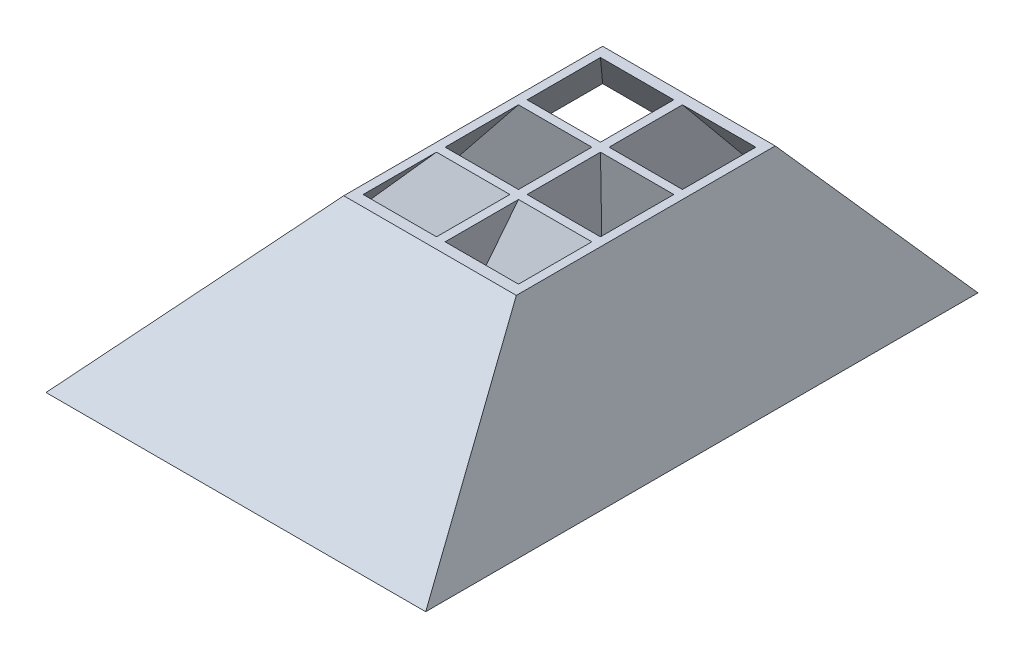
ISO-10303-21;
HEADER;
FILE_DESCRIPTION(('STEP AP214'),'2;1');
FILE_NAME('part.step','',(''),(''),'','','');
FILE_SCHEMA(('AUTOMOTIVE_DESIGN { 1 0 10303 214 1 1 1 1 }'));
ENDSEC;
DATA;
#1=APPLICATION_CONTEXT('core data for automotive mechanical design processes');
#2=APPLICATION_PROTOCOL_DEFINITION('international standard','automotive_design',2000,#1);
#3=PRODUCT_CONTEXT('',#1,'mechanical');
#4=PRODUCT('Part','Part','',(#3));
#5=PRODUCT_RELATED_PRODUCT_CATEGORY('part','',(#4));
#6=PRODUCT_DEFINITION_FORMATION('','',#4);
#7=PRODUCT_DEFINITION_CONTEXT('part definition',#1,'design');
#8=PRODUCT_DEFINITION('design','',#6,#7);
#9=PRODUCT_DEFINITION_SHAPE('','',#8);
#10=(LENGTH_UNIT() NAMED_UNIT(*) SI_UNIT(.MILLI.,.METRE.));
#11=(NAMED_UNIT(*) PLANE_ANGLE_UNIT() SI_UNIT($,.RADIAN.));
#12=(NAMED_UNIT(*) SI_UNIT($,.STERADIAN.) SOLID_ANGLE_UNIT());
#13=UNCERTAINTY_MEASURE_WITH_UNIT(LENGTH_MEASURE(1.E-05),#10,'distance_accuracy_value','');
#14=(GEOMETRIC_REPRESENTATION_CONTEXT(3) GLOBAL_UNCERTAINTY_ASSIGNED_CONTEXT((#13)) GLOBAL_UNIT_ASSIGNED_CONTEXT((#10,
#11,#12)) REPRESENTATION_CONTEXT('',''));
#15=CARTESIAN_POINT('',(0.,0.,0.));
#16=DIRECTION('',(0.,0.,1.));
#17=DIRECTION('',(1.,0.,0.));
#18=AXIS2_PLACEMENT_3D('',#15,#16,#17);
#19=CARTESIAN_POINT('',(37.5016060753418,20.,64.));
#20=DIRECTION('',(0.,-1.,0.));
#21=DIRECTION('',(1.,0.,0.));
#22=AXIS2_PLACEMENT_3D('',#19,#20,#21);
#23=PLANE('',#22);
#24=DIRECTION('',(1.,0.,0.));
#25=VECTOR('',#24,1.);
#26=CARTESIAN_POINT('',(28.001606075342,20.,37.25));
#27=LINE('',#26,#25);
#28=CARTESIAN_POINT('',(28.001606075342,20.,37.25));
#29=VERTEX_POINT('',#28);
#30=CARTESIAN_POINT('',(36.501606075342,20.,37.25));
#31=VERTEX_POINT('',#30);
#32=EDGE_CURVE('E275',#29,#31,#27,.T.);
#33=ORIENTED_EDGE('',*,*,#32,.T.);
#34=DIRECTION('',(0.,0.,1.));
#35=VECTOR('',#34,1.);
#36=CARTESIAN_POINT('',(36.501606075342,20.,37.25));
#37=LINE('',#36,#35);
#38=CARTESIAN_POINT('',(36.501606075342,20.,45.75));
#39=VERTEX_POINT('',#38);
#40=EDGE_CURVE('E285',#31,#39,#37,.T.);
#41=ORIENTED_EDGE('',*,*,#40,.T.);
#42=DIRECTION('',(1.,0.,0.));
#43=VECTOR('',#42,1.);
#44=CARTESIAN_POINT('',(28.001606075342,20.,45.75));
#45=LINE('',#44,#43);
#46=CARTESIAN_POINT('',(28.001606075342,20.,45.75));
#47=VERTEX_POINT('',#46);
#48=EDGE_CURVE('E85',#47,#39,#45,.T.);
#49=ORIENTED_EDGE('',*,*,#48,.F.);
#50=DIRECTION('',(0.,0.,1.));
#51=VECTOR('',#50,1.);
#52=CARTESIAN_POINT('',(28.001606075342,20.,37.25));
#53=LINE('',#52,#51);
#54=EDGE_CURVE('E292',#29,#47,#53,.T.);
#55=ORIENTED_EDGE('',*,*,#54,.F.);
#56=EDGE_LOOP('',(#33,#41,#49,#55));
#57=FACE_BOUND('',#56,.T.);
#58=DIRECTION('',(1.,0.,0.));
#59=VECTOR('',#58,1.);
#60=CARTESIAN_POINT('',(28.0016060753419,20.,27.75));
#61=LINE('',#60,#59);
#62=CARTESIAN_POINT('',(28.0016060753419,20.,27.75));
#63=VERTEX_POINT('',#62);
#64=CARTESIAN_POINT('',(36.5016060753419,20.,27.75));
#65=VERTEX_POINT('',#64);
#66=EDGE_CURVE('E323',#63,#65,#61,.T.);
#67=ORIENTED_EDGE('',*,*,#66,.T.);
#68=DIRECTION('',(0.,0.,1.));
#69=VECTOR('',#68,1.);
#70=CARTESIAN_POINT('',(36.5016060753419,20.,27.75));
#71=LINE('',#70,#69);
#72=CARTESIAN_POINT('',(36.5016060753419,20.,36.25));
#73=VERTEX_POINT('',#72);
#74=EDGE_CURVE('E412',#65,#73,#71,.T.);
#75=ORIENTED_EDGE('',*,*,#74,.T.);
#76=DIRECTION('',(1.,0.,0.));
#77=VECTOR('',#76,1.);
#78=CARTESIAN_POINT('',(28.0016060753419,20.,36.25));
#79=LINE('',#78,#77);
#80=CARTESIAN_POINT('',(28.0016060753419,20.,36.25));
#81=VERTEX_POINT('',#80);
#82=EDGE_CURVE('E406',#81,#73,#79,.T.);
#83=ORIENTED_EDGE('',*,*,#82,.F.);
#84=DIRECTION('',(0.,0.,1.));
#85=VECTOR('',#84,1.);
#86=CARTESIAN_POINT('',(28.0016060753419,20.,27.75));
#87=LINE('',#86,#85);
#88=EDGE_CURVE('E403',#63,#81,#87,.T.);
#89=ORIENTED_EDGE('',*,*,#88,.F.);
#90=EDGE_LOOP('',(#67,#75,#83,#89));
#91=FACE_BOUND('',#90,.T.);
#92=DIRECTION('',(0.,0.,1.));
#93=VECTOR('',#92,1.);
#94=CARTESIAN_POINT('',(18.501606075342,20.,37.2500000000001));
#95=LINE('',#94,#93);
#96=CARTESIAN_POINT('',(18.501606075342,20.,37.2500000000001));
#97=VERTEX_POINT('',#96);
#98=CARTESIAN_POINT('',(18.501606075342,20.,45.7500000000001));
#99=VERTEX_POINT('',#98);
#100=EDGE_CURVE('E663',#97,#99,#95,.T.);
#101=ORIENTED_EDGE('',*,*,#100,.F.);
#102=DIRECTION('',(1.,0.,0.));
#103=VECTOR('',#102,1.);
#104=CARTESIAN_POINT('',(18.501606075342,20.,37.2500000000001));
#105=LINE('',#104,#103);
#106=CARTESIAN_POINT('',(27.001606075342,20.,37.2500000000001));
#107=VERTEX_POINT('',#106);
#108=EDGE_CURVE('E662',#97,#107,#105,.T.);
#109=ORIENTED_EDGE('',*,*,#108,.T.);
#110=DIRECTION('',(0.,0.,1.));
#111=VECTOR('',#110,1.);
#112=CARTESIAN_POINT('',(27.001606075342,20.,37.2500000000001));
#113=LINE('',#112,#111);
#114=CARTESIAN_POINT('',(27.001606075342,20.,45.7500000000001));
#115=VERTEX_POINT('',#114);
#116=EDGE_CURVE('E668',#107,#115,#113,.T.);
#117=ORIENTED_EDGE('',*,*,#116,.T.);
#118=DIRECTION('',(1.,0.,0.));
#119=VECTOR('',#118,1.);
#120=CARTESIAN_POINT('',(18.501606075342,20.,45.7500000000001));
#121=LINE('',#120,#119);
#122=EDGE_CURVE('E671',#99,#115,#121,.T.);
#123=ORIENTED_EDGE('',*,*,#122,.F.);
#124=EDGE_LOOP('',(#101,#109,#117,#123));
#125=FACE_BOUND('',#124,.T.);
#126=DIRECTION('',(1.,0.,0.));
#127=VECTOR('',#126,1.);
#128=CARTESIAN_POINT('',(18.5016060753419,20.,27.7500000000001));
#129=LINE('',#128,#127);
#130=CARTESIAN_POINT('',(18.5016060753419,20.,27.7500000000001));
#131=VERTEX_POINT('',#130);
#132=CARTESIAN_POINT('',(27.0016060753419,20.,27.7500000000001));
#133=VERTEX_POINT('',#132);
#134=EDGE_CURVE('E605',#131,#133,#129,.T.);
#135=ORIENTED_EDGE('',*,*,#134,.T.);
#136=DIRECTION('',(0.,0.,1.));
#137=VECTOR('',#136,1.);
#138=CARTESIAN_POINT('',(27.0016060753419,20.,27.7500000000001));
#139=LINE('',#138,#137);
#140=CARTESIAN_POINT('',(27.0016060753419,20.,36.2500000000001));
#141=VERTEX_POINT('',#140);
#142=EDGE_CURVE('E602',#133,#141,#139,.T.);
#143=ORIENTED_EDGE('',*,*,#142,.T.);
#144=DIRECTION('',(1.,0.,0.));
#145=VECTOR('',#144,1.);
#146=CARTESIAN_POINT('',(18.5016060753419,20.,36.2500000000001));
#147=LINE('',#146,#145);
#148=CARTESIAN_POINT('',(18.5016060753419,20.,36.2500000000001));
#149=VERTEX_POINT('',#148);
#150=EDGE_CURVE('E599',#149,#141,#147,.T.);
#151=ORIENTED_EDGE('',*,*,#150,.F.);
#152=DIRECTION('',(0.,0.,1.));
#153=VECTOR('',#152,1.);
#154=CARTESIAN_POINT('',(18.5016060753419,20.,27.7500000000001));
#155=LINE('',#154,#153);
#156=EDGE_CURVE('E556',#131,#149,#155,.T.);
#157=ORIENTED_EDGE('',*,*,#156,.F.);
#158=EDGE_LOOP('',(#135,#143,#151,#157));
#159=FACE_BOUND('',#158,.T.);
#160=DIRECTION('',(1.,0.,0.));
#161=VECTOR('',#160,1.);
#162=CARTESIAN_POINT('',(18.5016060753418,20.,18.2500000000001));
#163=LINE('',#162,#161);
#164=CARTESIAN_POINT('',(18.5016060753418,20.,18.2500000000001));
#165=VERTEX_POINT('',#164);
#166=CARTESIAN_POINT('',(27.0016060753418,20.,18.2500000000001));
#167=VERTEX_POINT('',#166);
#168=EDGE_CURVE('E707',#165,#167,#163,.T.);
#169=ORIENTED_EDGE('',*,*,#168,.T.);
#170=DIRECTION('',(0.,0.,1.));
#171=VECTOR('',#170,1.);
#172=CARTESIAN_POINT('',(27.0016060753418,20.,18.2500000000001));
#173=LINE('',#172,#171);
#174=CARTESIAN_POINT('',(27.0016060753418,20.,26.7500000000001));
#175=VERTEX_POINT('',#174);
#176=EDGE_CURVE('E784',#167,#175,#173,.T.);
#177=ORIENTED_EDGE('',*,*,#176,.T.);
#178=DIRECTION('',(1.,0.,0.));
#179=VECTOR('',#178,1.);
#180=CARTESIAN_POINT('',(18.5016060753418,20.,26.7500000000001));
#181=LINE('',#180,#179);
#182=CARTESIAN_POINT('',(18.5016060753418,20.,26.7500000000001));
#183=VERTEX_POINT('',#182);
#184=EDGE_CURVE('E780',#183,#175,#181,.T.);
#185=ORIENTED_EDGE('',*,*,#184,.F.);
#186=DIRECTION('',(0.,0.,1.));
#187=VECTOR('',#186,1.);
#188=CARTESIAN_POINT('',(18.5016060753418,20.,18.2500000000001));
#189=LINE('',#188,#187);
#190=EDGE_CURVE('E777',#165,#183,#189,.T.);
#191=ORIENTED_EDGE('',*,*,#190,.F.);
#192=EDGE_LOOP('',(#169,#177,#185,#191));
#193=FACE_BOUND('',#192,.T.);
#194=DIRECTION('',(0.,0.,-1.));
#195=VECTOR('',#194,1.);
#196=CARTESIAN_POINT('',(37.5016060753418,20.,64.));
#197=LINE('',#196,#195);
#198=CARTESIAN_POINT('',(37.5016060753418,20.,47.));
#199=VERTEX_POINT('',#198);
#200=CARTESIAN_POINT('',(37.5016060753418,20.,17.));
#201=VERTEX_POINT('',#200);
#202=EDGE_CURVE('E12',#199,#201,#197,.T.);
#203=ORIENTED_EDGE('',*,*,#202,.T.);
#204=DIRECTION('',(-1.,0.,0.));
#205=VECTOR('',#204,1.);
#206=CARTESIAN_POINT('',(44.,20.,17.));
#207=LINE('',#206,#205);
#208=CARTESIAN_POINT('',(17.5016060753418,20.,17.));
#209=VERTEX_POINT('',#208);
#210=EDGE_CURVE('E712',#201,#209,#207,.T.);
#211=ORIENTED_EDGE('',*,*,#210,.T.);
#212=DIRECTION('',(0.,0.,-1.));
#213=VECTOR('',#212,1.);
#214=CARTESIAN_POINT('',(17.5016060753418,20.,64.));
#215=LINE('',#214,#213);
#216=CARTESIAN_POINT('',(17.5016060753418,20.,47.));
#217=VERTEX_POINT('',#216);
#218=EDGE_CURVE('E91',#217,#209,#215,.T.);
#219=ORIENTED_EDGE('',*,*,#218,.F.);
#220=DIRECTION('',(-1.,0.,0.));
#221=VECTOR('',#220,1.);
#222=CARTESIAN_POINT('',(44.,20.,47.));
#223=LINE('',#222,#221);
#224=EDGE_CURVE('E714',#199,#217,#223,.T.);
#225=ORIENTED_EDGE('',*,*,#224,.F.);
#226=EDGE_LOOP('',(#203,#211,#219,#225));
#227=FACE_BOUND('',#226,.T.);
#228=DIRECTION('',(1.,0.,0.));
#229=VECTOR('',#228,1.);
#230=CARTESIAN_POINT('',(28.0016060753418,20.,18.25));
#231=LINE('',#230,#229);
#232=CARTESIAN_POINT('',(28.0016060753418,20.,18.25));
#233=VERTEX_POINT('',#232);
#234=CARTESIAN_POINT('',(36.5016060753418,20.,18.25));
#235=VERTEX_POINT('',#234);
#236=EDGE_CURVE('E332',#233,#235,#231,.T.);
#237=ORIENTED_EDGE('',*,*,#236,.T.);
#238=DIRECTION('',(0.,0.,1.));
#239=VECTOR('',#238,1.);
#240=CARTESIAN_POINT('',(36.5016060753418,20.,18.25));
#241=LINE('',#240,#239);
#242=CARTESIAN_POINT('',(36.5016060753418,20.,26.75));
#243=VERTEX_POINT('',#242);
#244=EDGE_CURVE('E376',#235,#243,#241,.T.);
#245=ORIENTED_EDGE('',*,*,#244,.T.);
#246=DIRECTION('',(1.,0.,0.));
#247=VECTOR('',#246,1.);
#248=CARTESIAN_POINT('',(28.0016060753418,20.,26.75));
#249=LINE('',#248,#247);
#250=CARTESIAN_POINT('',(28.0016060753418,20.,26.75));
#251=VERTEX_POINT('',#250);
#252=EDGE_CURVE('E381',#251,#243,#249,.T.);
#253=ORIENTED_EDGE('',*,*,#252,.F.);
#254=DIRECTION('',(0.,0.,1.));
#255=VECTOR('',#254,1.);
#256=CARTESIAN_POINT('',(28.0016060753418,20.,18.25));
#257=LINE('',#256,#255);
#258=EDGE_CURVE('E379',#233,#251,#257,.T.);
#259=ORIENTED_EDGE('',*,*,#258,.F.);
#260=EDGE_LOOP('',(#237,#245,#253,#259));
#261=FACE_BOUND('',#260,.T.);
#262=ADVANCED_FACE('F81',(#57,#91,#125,#159,#193,#227,#261),#23,.F.);
#263=CARTESIAN_POINT('',(0.,0.,64.));
#264=DIRECTION('',(0.,1.,0.));
#265=DIRECTION('',(0.,0.,1.));
#266=AXIS2_PLACEMENT_3D('',#263,#264,#265);
#267=PLANE('',#266);
#268=DIRECTION('',(1.,0.,0.));
#269=VECTOR('',#268,1.);
#270=CARTESIAN_POINT('',(22.25,0.,63.25));
#271=LINE('',#270,#269);
#272=CARTESIAN_POINT('',(22.25,0.,63.25));
#273=VERTEX_POINT('',#272);
#274=CARTESIAN_POINT('',(42.75,0.,63.25));
#275=VERTEX_POINT('',#274);
#276=EDGE_CURVE('E107',#273,#275,#271,.T.);
#277=ORIENTED_EDGE('',*,*,#276,.T.);
#278=DIRECTION('',(0.,0.,-1.));
#279=VECTOR('',#278,1.);
#280=CARTESIAN_POINT('',(42.75,0.,63.25));
#281=LINE('',#280,#279);
#282=CARTESIAN_POINT('',(42.75,0.,42.75));
#283=VERTEX_POINT('',#282);
#284=EDGE_CURVE('E304',#275,#283,#281,.T.);
#285=ORIENTED_EDGE('',*,*,#284,.T.);
#286=DIRECTION('',(1.,0.,0.));
#287=VECTOR('',#286,1.);
#288=CARTESIAN_POINT('',(22.25,0.,42.75));
#289=LINE('',#288,#287);
#290=CARTESIAN_POINT('',(22.25,0.,42.75));
#291=VERTEX_POINT('',#290);
#292=EDGE_CURVE('E278',#291,#283,#289,.T.);
#293=ORIENTED_EDGE('',*,*,#292,.F.);
#294=DIRECTION('',(0.,0.,-1.));
#295=VECTOR('',#294,1.);
#296=CARTESIAN_POINT('',(22.25,0.,63.25));
#297=LINE('',#296,#295);
#298=EDGE_CURVE('E407',#273,#291,#297,.T.);
#299=ORIENTED_EDGE('',*,*,#298,.F.);
#300=EDGE_LOOP('',(#277,#285,#293,#299));
#301=FACE_BOUND('',#300,.T.);
#302=DIRECTION('',(1.,0.,0.));
#303=VECTOR('',#302,1.);
#304=CARTESIAN_POINT('',(22.2500000000002,0.,42.25));
#305=LINE('',#304,#303);
#306=CARTESIAN_POINT('',(22.2500000000002,0.,42.25));
#307=VERTEX_POINT('',#306);
#308=CARTESIAN_POINT('',(42.7500000000002,0.,42.25));
#309=VERTEX_POINT('',#308);
#310=EDGE_CURVE('E382',#307,#309,#305,.T.);
#311=ORIENTED_EDGE('',*,*,#310,.T.);
#312=DIRECTION('',(0.,0.,-1.));
#313=VECTOR('',#312,1.);
#314=CARTESIAN_POINT('',(42.7500000000002,0.,42.25));
#315=LINE('',#314,#313);
#316=CARTESIAN_POINT('',(42.7500000000002,0.,21.75));
#317=VERTEX_POINT('',#316);
#318=EDGE_CURVE('E392',#309,#317,#315,.T.);
#319=ORIENTED_EDGE('',*,*,#318,.T.);
#320=DIRECTION('',(1.,0.,0.));
#321=VECTOR('',#320,1.);
#322=CARTESIAN_POINT('',(22.2500000000002,0.,21.75));
#323=LINE('',#322,#321);
#324=CARTESIAN_POINT('',(22.2500000000002,0.,21.75));
#325=VERTEX_POINT('',#324);
#326=EDGE_CURVE('E387',#325,#317,#323,.T.);
#327=ORIENTED_EDGE('',*,*,#326,.F.);
#328=DIRECTION('',(0.,0.,-1.));
#329=VECTOR('',#328,1.);
#330=CARTESIAN_POINT('',(22.2500000000002,0.,42.25));
#331=LINE('',#330,#329);
#332=EDGE_CURVE('E313',#307,#325,#331,.T.);
#333=ORIENTED_EDGE('',*,*,#332,.F.);
#334=EDGE_LOOP('',(#311,#319,#327,#333));
#335=FACE_BOUND('',#334,.T.);
#336=DIRECTION('',(0.,0.,-1.));
#337=VECTOR('',#336,1.);
#338=CARTESIAN_POINT('',(1.24999999999999,0.,63.2499999999999));
#339=LINE('',#338,#337);
#340=CARTESIAN_POINT('',(1.24999999999999,0.,63.2499999999999));
#341=VERTEX_POINT('',#340);
#342=CARTESIAN_POINT('',(1.24999999999999,0.,42.7499999999998));
#343=VERTEX_POINT('',#342);
#344=EDGE_CURVE('E544',#341,#343,#339,.T.);
#345=ORIENTED_EDGE('',*,*,#344,.F.);
#346=DIRECTION('',(1.,0.,0.));
#347=VECTOR('',#346,1.);
#348=CARTESIAN_POINT('',(1.24999999999999,0.,63.2499999999999));
#349=LINE('',#348,#347);
#350=CARTESIAN_POINT('',(21.75,0.,63.2499999999999));
#351=VERTEX_POINT('',#350);
#352=EDGE_CURVE('E537',#341,#351,#349,.T.);
#353=ORIENTED_EDGE('',*,*,#352,.T.);
#354=DIRECTION('',(0.,0.,-1.));
#355=VECTOR('',#354,1.);
#356=CARTESIAN_POINT('',(21.75,0.,63.2499999999999));
#357=LINE('',#356,#355);
#358=CARTESIAN_POINT('',(21.75,0.,42.7499999999999));
#359=VERTEX_POINT('',#358);
#360=EDGE_CURVE('E528',#351,#359,#357,.T.);
#361=ORIENTED_EDGE('',*,*,#360,.T.);
#362=DIRECTION('',(1.,0.,0.));
#363=VECTOR('',#362,1.);
#364=CARTESIAN_POINT('',(1.24999999999999,0.,42.7499999999998));
#365=LINE('',#364,#363);
#366=EDGE_CURVE('E536',#343,#359,#365,.T.);
#367=ORIENTED_EDGE('',*,*,#366,.F.);
#368=EDGE_LOOP('',(#345,#353,#361,#367));
#369=FACE_BOUND('',#368,.T.);
#370=DIRECTION('',(1.,0.,0.));
#371=VECTOR('',#370,1.);
#372=CARTESIAN_POINT('',(1.25000000000021,0.,42.2499999999998));
#373=LINE('',#372,#371);
#374=CARTESIAN_POINT('',(1.25000000000021,0.,42.2499999999998));
#375=VERTEX_POINT('',#374);
#376=CARTESIAN_POINT('',(21.7500000000002,0.,42.2499999999998));
#377=VERTEX_POINT('',#376);
#378=EDGE_CURVE('E1181',#375,#377,#373,.T.);
#379=ORIENTED_EDGE('',*,*,#378,.T.);
#380=DIRECTION('',(0.,0.,-1.));
#381=VECTOR('',#380,1.);
#382=CARTESIAN_POINT('',(21.7500000000002,0.,42.2499999999998));
#383=LINE('',#382,#381);
#384=CARTESIAN_POINT('',(21.7500000000002,0.,21.7499999999999));
#385=VERTEX_POINT('',#384);
#386=EDGE_CURVE('E1190',#377,#385,#383,.T.);
#387=ORIENTED_EDGE('',*,*,#386,.T.);
#388=DIRECTION('',(1.,0.,0.));
#389=VECTOR('',#388,1.);
#390=CARTESIAN_POINT('',(1.25000000000021,0.,21.7499999999998));
#391=LINE('',#390,#389);
#392=CARTESIAN_POINT('',(1.25000000000021,0.,21.7499999999998));
#393=VERTEX_POINT('',#392);
#394=EDGE_CURVE('E1193',#393,#385,#391,.T.);
#395=ORIENTED_EDGE('',*,*,#394,.F.);
#396=DIRECTION('',(0.,0.,-1.));
#397=VECTOR('',#396,1.);
#398=CARTESIAN_POINT('',(1.25000000000021,0.,42.2499999999998));
#399=LINE('',#398,#397);
#400=EDGE_CURVE('E781',#375,#393,#399,.T.);
#401=ORIENTED_EDGE('',*,*,#400,.F.);
#402=EDGE_LOOP('',(#379,#387,#395,#401));
#403=FACE_BOUND('',#402,.T.);
#404=DIRECTION('',(1.,0.,0.));
#405=VECTOR('',#404,1.);
#406=CARTESIAN_POINT('',(1.25000000000043,0.,21.2499999999998));
#407=LINE('',#406,#405);
#408=CARTESIAN_POINT('',(1.25000000000043,0.,21.2499999999998));
#409=VERTEX_POINT('',#408);
#410=CARTESIAN_POINT('',(21.7500000000004,0.,21.2499999999998));
#411=VERTEX_POINT('',#410);
#412=EDGE_CURVE('E752',#409,#411,#407,.T.);
#413=ORIENTED_EDGE('',*,*,#412,.T.);
#414=DIRECTION('',(0.,0.,-1.));
#415=VECTOR('',#414,1.);
#416=CARTESIAN_POINT('',(21.7500000000004,0.,21.2499999999998));
#417=LINE('',#416,#415);
#418=CARTESIAN_POINT('',(21.7500000000004,0.,0.749999999999851));
#419=VERTEX_POINT('',#418);
#420=EDGE_CURVE('E759',#411,#419,#417,.T.);
#421=ORIENTED_EDGE('',*,*,#420,.T.);
#422=DIRECTION('',(1.,0.,0.));
#423=VECTOR('',#422,1.);
#424=CARTESIAN_POINT('',(1.25000000000043,0.,0.749999999999841));
#425=LINE('',#424,#423);
#426=CARTESIAN_POINT('',(1.25000000000043,0.,0.749999999999848));
#427=VERTEX_POINT('',#426);
#428=EDGE_CURVE('E754',#427,#419,#425,.T.);
#429=ORIENTED_EDGE('',*,*,#428,.F.);
#430=DIRECTION('',(0.,0.,-1.));
#431=VECTOR('',#430,1.);
#432=CARTESIAN_POINT('',(1.25000000000043,0.,21.2499999999998));
#433=LINE('',#432,#431);
#434=EDGE_CURVE('E748',#409,#427,#433,.T.);
#435=ORIENTED_EDGE('',*,*,#434,.F.);
#436=EDGE_LOOP('',(#413,#421,#429,#435));
#437=FACE_BOUND('',#436,.T.);
#438=DIRECTION('',(1.,0.,0.));
#439=VECTOR('',#438,1.);
#440=CARTESIAN_POINT('',(0.,0.,0.));
#441=LINE('',#440,#439);
#442=CARTESIAN_POINT('',(0.,0.,0.));
#443=VERTEX_POINT('',#442);
#444=CARTESIAN_POINT('',(44.,0.,0.));
#445=VERTEX_POINT('',#444);
#446=EDGE_CURVE('E735',#443,#445,#441,.T.);
#447=ORIENTED_EDGE('',*,*,#446,.T.);
#448=DIRECTION('',(0.,0.,-1.));
#449=VECTOR('',#448,1.);
#450=CARTESIAN_POINT('',(44.,0.,64.));
#451=LINE('',#450,#449);
#452=CARTESIAN_POINT('',(44.,0.,64.));
#453=VERTEX_POINT('',#452);
#454=EDGE_CURVE('E722',#453,#445,#451,.T.);
#455=ORIENTED_EDGE('',*,*,#454,.F.);
#456=DIRECTION('',(1.,0.,0.));
#457=VECTOR('',#456,1.);
#458=CARTESIAN_POINT('',(0.,0.,64.));
#459=LINE('',#458,#457);
#460=CARTESIAN_POINT('',(0.,0.,64.));
#461=VERTEX_POINT('',#460);
#462=EDGE_CURVE('E736',#461,#453,#459,.T.);
#463=ORIENTED_EDGE('',*,*,#462,.F.);
#464=DIRECTION('',(0.,0.,-1.));
#465=VECTOR('',#464,1.);
#466=CARTESIAN_POINT('',(0.,0.,64.));
#467=LINE('',#466,#465);
#468=EDGE_CURVE('E740',#461,#443,#467,.T.);
#469=ORIENTED_EDGE('',*,*,#468,.T.);
#470=EDGE_LOOP('',(#447,#455,#463,#469));
#471=FACE_BOUND('',#470,.T.);
#472=DIRECTION('',(1.,0.,0.));
#473=VECTOR('',#472,1.);
#474=CARTESIAN_POINT('',(22.2500000000004,0.,0.749999999999987));
#475=LINE('',#474,#473);
#476=CARTESIAN_POINT('',(22.2500000000004,0.,0.749999999999983));
#477=VERTEX_POINT('',#476);
#478=CARTESIAN_POINT('',(42.7500000000004,0.,0.749999999999994));
#479=VERTEX_POINT('',#478);
#480=EDGE_CURVE('E1157',#477,#479,#475,.T.);
#481=ORIENTED_EDGE('',*,*,#480,.F.);
#482=DIRECTION('',(0.,0.,-1.));
#483=VECTOR('',#482,1.);
#484=CARTESIAN_POINT('',(22.2500000000004,0.,21.25));
#485=LINE('',#484,#483);
#486=CARTESIAN_POINT('',(22.2500000000004,0.,21.25));
#487=VERTEX_POINT('',#486);
#488=EDGE_CURVE('E1150',#487,#477,#485,.T.);
#489=ORIENTED_EDGE('',*,*,#488,.F.);
#490=DIRECTION('',(1.,0.,0.));
#491=VECTOR('',#490,1.);
#492=CARTESIAN_POINT('',(22.2500000000004,0.,21.25));
#493=LINE('',#492,#491);
#494=CARTESIAN_POINT('',(42.7500000000004,0.,21.25));
#495=VERTEX_POINT('',#494);
#496=EDGE_CURVE('E492',#487,#495,#493,.T.);
#497=ORIENTED_EDGE('',*,*,#496,.T.);
#498=DIRECTION('',(0.,0.,-1.));
#499=VECTOR('',#498,1.);
#500=CARTESIAN_POINT('',(42.7500000000004,0.,21.25));
#501=LINE('',#500,#499);
#502=EDGE_CURVE('E1160',#495,#479,#501,.T.);
#503=ORIENTED_EDGE('',*,*,#502,.T.);
#504=EDGE_LOOP('',(#481,#489,#497,#503));
#505=FACE_BOUND('',#504,.T.);
#506=ADVANCED_FACE('F431',(#301,#335,#369,#403,#437,#471,#505),#267,.F.);
#507=CARTESIAN_POINT('',(44.,0.,64.));
#508=DIRECTION('',(-0.951056516295152,-0.309016994374952,0.));
#509=DIRECTION('',(0.309016994374952,-0.951056516295152,0.));
#510=AXIS2_PLACEMENT_3D('',#507,#508,#509);
#511=PLANE('',#510);
#512=ORIENTED_EDGE('',*,*,#454,.T.);
#513=DIRECTION('',(-0.240314122722964,0.739610819255167,0.628669196366892));
#514=VECTOR('',#513,1.);
#515=CARTESIAN_POINT('',(34.3310024698969,29.7581145193859,25.294397341478));
#516=LINE('',#515,#514);
#517=EDGE_CURVE('E721',#445,#201,#516,.T.);
#518=ORIENTED_EDGE('',*,*,#517,.T.);
#519=ORIENTED_EDGE('',*,*,#202,.F.);
#520=DIRECTION('',(0.240314122722964,-0.739610819255167,0.628669196366892));
#521=VECTOR('',#520,1.);
#522=CARTESIAN_POINT('',(44.,0.,64.));
#523=LINE('',#522,#521);
#524=EDGE_CURVE('E719',#199,#453,#523,.T.);
#525=ORIENTED_EDGE('',*,*,#524,.T.);
#526=EDGE_LOOP('',(#512,#518,#519,#525));
#527=FACE_BOUND('',#526,.T.);
#528=ADVANCED_FACE('F83',(#527),#511,.F.);
#529=CARTESIAN_POINT('',(17.5016060753418,20.,64.));
#530=DIRECTION('',(0.752546745159007,-0.658538834352678,0.));
#531=DIRECTION('',(0.658538834352678,0.752546745159007,0.));
#532=AXIS2_PLACEMENT_3D('',#529,#530,#531);
#533=PLANE('',#532);
#534=ORIENTED_EDGE('',*,*,#218,.T.);
#535=DIRECTION('',(-0.554752855706336,-0.633945082889203,-0.538853320455823));
#536=VECTOR('',#535,1.);
#537=CARTESIAN_POINT('',(31.5513357368381,36.05536040637,30.6470563454145));
#538=LINE('',#537,#536);
#539=EDGE_CURVE('E726',#209,#443,#538,.T.);
#540=ORIENTED_EDGE('',*,*,#539,.T.);
#541=ORIENTED_EDGE('',*,*,#468,.F.);
#542=DIRECTION('',(0.554752855706336,0.633945082889203,-0.538853320455823));
#543=VECTOR('',#542,1.);
#544=CARTESIAN_POINT('',(12.4197889637367,14.1927419806747,51.9361693164265));
#545=LINE('',#544,#543);
#546=EDGE_CURVE('E725',#461,#217,#545,.T.);
#547=ORIENTED_EDGE('',*,*,#546,.T.);
#548=EDGE_LOOP('',(#534,#540,#541,#547));
#549=FACE_BOUND('',#548,.T.);
#550=ADVANCED_FACE('F443',(#549),#533,.F.);
#551=CARTESIAN_POINT('',(44.,0.,0.));
#552=DIRECTION('',(0.,-0.647648420095541,0.761939317759459));
#553=DIRECTION('',(0.,-0.761939317759459,-0.647648420095541));
#554=AXIS2_PLACEMENT_3D('',#551,#552,#553);
#555=PLANE('',#554);
#556=ORIENTED_EDGE('',*,*,#446,.F.);
#557=ORIENTED_EDGE('',*,*,#539,.F.);
#558=ORIENTED_EDGE('',*,*,#210,.F.);
#559=ORIENTED_EDGE('',*,*,#517,.F.);
#560=EDGE_LOOP('',(#556,#557,#558,#559));
#561=FACE_BOUND('',#560,.T.);
#562=ADVANCED_FACE('F845',(#561),#555,.F.);
#563=CARTESIAN_POINT('',(44.,0.,64.));
#564=DIRECTION('',(0.,-0.647648420095541,-0.761939317759459));
#565=DIRECTION('',(0.,0.761939317759459,-0.647648420095541));
#566=AXIS2_PLACEMENT_3D('',#563,#564,#565);
#567=PLANE('',#566);
#568=ORIENTED_EDGE('',*,*,#224,.T.);
#569=ORIENTED_EDGE('',*,*,#546,.F.);
#570=ORIENTED_EDGE('',*,*,#462,.T.);
#571=ORIENTED_EDGE('',*,*,#524,.F.);
#572=EDGE_LOOP('',(#568,#569,#570,#571));
#573=FACE_BOUND('',#572,.T.);
#574=ADVANCED_FACE('F441',(#573),#567,.F.);
#575=CARTESIAN_POINT('',(20.347099706538,-5.34274762172154,0.));
#576=DIRECTION('',(0.967211888410285,-0.25397079146589,0.));
#577=DIRECTION('',(0.25397079146589,0.967211888410285,0.));
#578=AXIS2_PLACEMENT_3D('',#575,#576,#577);
#579=PLANE('',#578);
#580=DIRECTION('',(-0.245437161169701,-0.93471276271897,-0.257046009747727));
#581=VECTOR('',#580,1.);
#582=CARTESIAN_POINT('',(27.0016060753418,20.,26.7500000000001));
#583=LINE('',#582,#581);
#584=EDGE_CURVE('E790',#175,#411,#583,.T.);
#585=ORIENTED_EDGE('',*,*,#584,.F.);
#586=ORIENTED_EDGE('',*,*,#176,.F.);
#587=DIRECTION('',(-0.193862852379713,-0.738299292058433,-0.646011880551137));
#588=VECTOR('',#587,1.);
#589=CARTESIAN_POINT('',(27.0016060753418,20.,18.2500000000001));
#590=LINE('',#589,#588);
#591=EDGE_CURVE('E822',#167,#419,#590,.T.);
#592=ORIENTED_EDGE('',*,*,#591,.T.);
#593=ORIENTED_EDGE('',*,*,#420,.F.);
#594=EDGE_LOOP('',(#585,#586,#592,#593));
#595=FACE_BOUND('',#594,.T.);
#596=ADVANCED_FACE('F577',(#595),#579,.F.);
#597=CARTESIAN_POINT('',(0.,-0.371681415929125,0.424778761061852));
#598=DIRECTION('',(0.,-0.658504607868523,0.752576694706874));
#599=DIRECTION('',(0.,-0.752576694706874,-0.658504607868523));
#600=AXIS2_PLACEMENT_3D('',#597,#598,#599);
#601=PLANE('',#600);
#602=ORIENTED_EDGE('',*,*,#591,.F.);
#603=ORIENTED_EDGE('',*,*,#168,.F.);
#604=DIRECTION('',(-0.544491678229655,-0.631235927660008,-0.552331436702514));
#605=VECTOR('',#604,1.);
#606=CARTESIAN_POINT('',(18.5016060753418,20.,18.2500000000001));
#607=LINE('',#606,#605);
#608=EDGE_CURVE('E757',#165,#427,#607,.T.);
#609=ORIENTED_EDGE('',*,*,#608,.T.);
#610=ORIENTED_EDGE('',*,*,#428,.T.);
#611=EDGE_LOOP('',(#602,#603,#609,#610));
#612=FACE_BOUND('',#611,.T.);
#613=ADVANCED_FACE('F798',(#612),#601,.T.);
#614=CARTESIAN_POINT('',(0.,-5.43288785589789,19.7559558396279));
#615=DIRECTION('',(0.,-0.265156483021052,0.964205392803788));
#616=DIRECTION('',(0.,-0.964205392803788,-0.265156483021052));
#617=AXIS2_PLACEMENT_3D('',#614,#615,#616);
#618=PLANE('',#617);
#619=DIRECTION('',(-0.63944507360227,-0.741316571697361,-0.203862057216783));
#620=VECTOR('',#619,1.);
#621=CARTESIAN_POINT('',(18.5016060753418,20.,26.7500000000001));
#622=LINE('',#621,#620);
#623=EDGE_CURVE('E761',#183,#409,#622,.T.);
#624=ORIENTED_EDGE('',*,*,#623,.F.);
#625=ORIENTED_EDGE('',*,*,#184,.T.);
#626=ORIENTED_EDGE('',*,*,#584,.T.);
#627=ORIENTED_EDGE('',*,*,#412,.F.);
#628=EDGE_LOOP('',(#624,#625,#626,#627));
#629=FACE_BOUND('',#628,.T.);
#630=ADVANCED_FACE('F807',(#629),#618,.F.);
#631=CARTESIAN_POINT('',(0.716724716024861,-0.618232623266089,0.));
#632=DIRECTION('',(0.757218444584975,-0.653161715948134,0.));
#633=DIRECTION('',(0.653161715948134,0.757218444584975,0.));
#634=AXIS2_PLACEMENT_3D('',#631,#632,#633);
#635=PLANE('',#634);
#636=ORIENTED_EDGE('',*,*,#608,.F.);
#637=ORIENTED_EDGE('',*,*,#190,.T.);
#638=ORIENTED_EDGE('',*,*,#623,.T.);
#639=ORIENTED_EDGE('',*,*,#434,.T.);
#640=EDGE_LOOP('',(#636,#637,#638,#639));
#641=FACE_BOUND('',#640,.T.);
#642=ADVANCED_FACE('F836',(#641),#635,.T.);
#643=CARTESIAN_POINT('',(20.3470997065377,-5.34274762172177,0.));
#644=DIRECTION('',(0.967211888410281,-0.253970791465905,0.));
#645=DIRECTION('',(0.253970791465905,0.967211888410281,0.));
#646=AXIS2_PLACEMENT_3D('',#643,#644,#645);
#647=PLANE('',#646);
#648=DIRECTION('',(-0.243910273565808,-0.928897826937411,0.278669348081213));
#649=VECTOR('',#648,1.);
#650=CARTESIAN_POINT('',(27.0016060753419,20.,36.2500000000001));
#651=LINE('',#650,#649);
#652=EDGE_CURVE('E598',#141,#377,#651,.T.);
#653=ORIENTED_EDGE('',*,*,#652,.F.);
#654=ORIENTED_EDGE('',*,*,#142,.F.);
#655=DIRECTION('',(-0.243910273565807,-0.928897826937406,-0.278669348081232));
#656=VECTOR('',#655,1.);
#657=CARTESIAN_POINT('',(27.0016060753419,20.,27.7500000000001));
#658=LINE('',#657,#656);
#659=EDGE_CURVE('E1182',#133,#385,#658,.T.);
#660=ORIENTED_EDGE('',*,*,#659,.T.);
#661=ORIENTED_EDGE('',*,*,#386,.F.);
#662=EDGE_LOOP('',(#653,#654,#660,#661));
#663=FACE_BOUND('',#662,.T.);
#664=ADVANCED_FACE('F844',(#663),#647,.F.);
#665=CARTESIAN_POINT('',(0.,-5.98623853211023,19.9541284403667));
#666=DIRECTION('',(0.,-0.287347885566355,0.957826285221149));
#667=DIRECTION('',(0.,-0.957826285221149,-0.287347885566355));
#668=AXIS2_PLACEMENT_3D('',#665,#666,#667);
#669=PLANE('',#668);
#670=ORIENTED_EDGE('',*,*,#659,.F.);
#671=ORIENTED_EDGE('',*,*,#134,.F.);
#672=DIRECTION('',(-0.636934201068214,-0.738405686156499,-0.221521705846958));
#673=VECTOR('',#672,1.);
#674=CARTESIAN_POINT('',(18.5016060753419,20.,27.7500000000001));
#675=LINE('',#674,#673);
#676=EDGE_CURVE('E562',#131,#393,#675,.T.);
#677=ORIENTED_EDGE('',*,*,#676,.T.);
#678=ORIENTED_EDGE('',*,*,#394,.T.);
#679=EDGE_LOOP('',(#670,#671,#677,#678));
#680=FACE_BOUND('',#679,.T.);
#681=ADVANCED_FACE('F884',(#680),#669,.T.);
#682=CARTESIAN_POINT('',(0.,11.6284403669721,38.7614678899084));
#683=DIRECTION('',(0.,0.287347885566336,0.957826285221154));
#684=DIRECTION('',(0.,-0.957826285221154,0.287347885566336));
#685=AXIS2_PLACEMENT_3D('',#682,#683,#684);
#686=PLANE('',#685);
#687=DIRECTION('',(-0.636934201068216,-0.738405686156502,0.221521705846942));
#688=VECTOR('',#687,1.);
#689=CARTESIAN_POINT('',(18.5016060753419,20.,36.2500000000001));
#690=LINE('',#689,#688);
#691=EDGE_CURVE('E1176',#149,#375,#690,.T.);
#692=ORIENTED_EDGE('',*,*,#691,.F.);
#693=ORIENTED_EDGE('',*,*,#150,.T.);
#694=ORIENTED_EDGE('',*,*,#652,.T.);
#695=ORIENTED_EDGE('',*,*,#378,.F.);
#696=EDGE_LOOP('',(#692,#693,#694,#695));
#697=FACE_BOUND('',#696,.T.);
#698=ADVANCED_FACE('F575',(#697),#686,.F.);
#699=CARTESIAN_POINT('',(0.716724716024725,-0.618232623265983,0.));
#700=DIRECTION('',(0.757218444584969,-0.653161715948141,0.));
#701=DIRECTION('',(0.653161715948141,0.75721844458497,0.));
#702=AXIS2_PLACEMENT_3D('',#699,#700,#701);
#703=PLANE('',#702);
#704=ORIENTED_EDGE('',*,*,#676,.F.);
#705=ORIENTED_EDGE('',*,*,#156,.T.);
#706=ORIENTED_EDGE('',*,*,#691,.T.);
#707=ORIENTED_EDGE('',*,*,#400,.T.);
#708=EDGE_LOOP('',(#704,#705,#706,#707));
#709=FACE_BOUND('',#708,.T.);
#710=ADVANCED_FACE('F564',(#709),#703,.T.);
#711=CARTESIAN_POINT('',(0.71672471602459,-0.618232623265878,0.));
#712=DIRECTION('',(0.757218444584963,-0.653161715948148,0.));
#713=DIRECTION('',(0.653161715948148,0.757218444584963,0.));
#714=AXIS2_PLACEMENT_3D('',#711,#712,#713);
#715=PLANE('',#714);
#716=DIRECTION('',(-0.639445073602286,-0.741316571697352,0.203862057216764));
#717=VECTOR('',#716,1.);
#718=CARTESIAN_POINT('',(18.501606075342,20.,37.2500000000001));
#719=LINE('',#718,#717);
#720=EDGE_CURVE('E656',#97,#343,#719,.T.);
#721=ORIENTED_EDGE('',*,*,#720,.F.);
#722=ORIENTED_EDGE('',*,*,#100,.T.);
#723=DIRECTION('',(-0.544491678229674,-0.631235927660006,0.552331436702498));
#724=VECTOR('',#723,1.);
#725=CARTESIAN_POINT('',(18.501606075342,20.,45.7500000000001));
#726=LINE('',#725,#724);
#727=EDGE_CURVE('E618',#99,#341,#726,.T.);
#728=ORIENTED_EDGE('',*,*,#727,.T.);
#729=ORIENTED_EDGE('',*,*,#344,.T.);
#730=EDGE_LOOP('',(#721,#722,#728,#729));
#731=FACE_BOUND('',#730,.T.);
#732=ADVANCED_FACE('F574',(#731),#715,.T.);
#733=CARTESIAN_POINT('',(0.,31.3451327433627,35.8230088495578));
#734=DIRECTION('',(0.,0.658504607868513,0.752576694706882));
#735=DIRECTION('',(0.,-0.752576694706882,0.658504607868513));
#736=AXIS2_PLACEMENT_3D('',#733,#734,#735);
#737=PLANE('',#736);
#738=ORIENTED_EDGE('',*,*,#727,.F.);
#739=ORIENTED_EDGE('',*,*,#122,.T.);
#740=DIRECTION('',(-0.193862852379738,-0.738299292058438,0.646011880551125));
#741=VECTOR('',#740,1.);
#742=CARTESIAN_POINT('',(27.001606075342,20.,45.7500000000001));
#743=LINE('',#742,#741);
#744=EDGE_CURVE('E543',#115,#351,#743,.T.);
#745=ORIENTED_EDGE('',*,*,#744,.T.);
#746=ORIENTED_EDGE('',*,*,#352,.F.);
#747=EDGE_LOOP('',(#738,#739,#745,#746));
#748=FACE_BOUND('',#747,.T.);
#749=ADVANCED_FACE('F616',(#748),#737,.F.);
#750=CARTESIAN_POINT('',(0.,10.9296920395115,39.7443346891343));
#751=DIRECTION('',(0.,0.265156483021033,0.964205392803793));
#752=DIRECTION('',(0.,-0.964205392803793,0.265156483021033));
#753=AXIS2_PLACEMENT_3D('',#750,#751,#752);
#754=PLANE('',#753);
#755=DIRECTION('',(-0.24543716116973,-0.934712762718968,0.257046009747706));
#756=VECTOR('',#755,1.);
#757=CARTESIAN_POINT('',(27.001606075342,20.,37.2500000000001));
#758=LINE('',#757,#756);
#759=EDGE_CURVE('E691',#107,#359,#758,.T.);
#760=ORIENTED_EDGE('',*,*,#759,.F.);
#761=ORIENTED_EDGE('',*,*,#108,.F.);
#762=ORIENTED_EDGE('',*,*,#720,.T.);
#763=ORIENTED_EDGE('',*,*,#366,.T.);
#764=EDGE_LOOP('',(#760,#761,#762,#763));
#765=FACE_BOUND('',#764,.T.);
#766=ADVANCED_FACE('F639',(#765),#754,.T.);
#767=CARTESIAN_POINT('',(20.3470997065373,-5.34274762172199,0.));
#768=DIRECTION('',(0.967211888410277,-0.253970791465919,0.));
#769=DIRECTION('',(0.253970791465919,0.967211888410277,0.));
#770=AXIS2_PLACEMENT_3D('',#767,#768,#769);
#771=PLANE('',#770);
#772=ORIENTED_EDGE('',*,*,#744,.F.);
#773=ORIENTED_EDGE('',*,*,#116,.F.);
#774=ORIENTED_EDGE('',*,*,#759,.T.);
#775=ORIENTED_EDGE('',*,*,#360,.F.);
#776=EDGE_LOOP('',(#772,#773,#774,#775));
#777=FACE_BOUND('',#776,.T.);
#778=ADVANCED_FACE('F351',(#777),#771,.F.);
#779=CARTESIAN_POINT('',(0.,-0.371681415929193,0.424778761061935));
#780=DIRECTION('',(0.,-0.658504607868518,0.752576694706878));
#781=DIRECTION('',(0.,-0.752576694706878,-0.658504607868518));
#782=AXIS2_PLACEMENT_3D('',#779,#780,#781);
#783=PLANE('',#782);
#784=DIRECTION('',(0.228878525729282,-0.732599539942691,-0.641024597449855));
#785=VECTOR('',#784,1.);
#786=CARTESIAN_POINT('',(36.5016060753418,20.,18.25));
#787=LINE('',#786,#785);
#788=EDGE_CURVE('E375',#235,#479,#787,.T.);
#789=ORIENTED_EDGE('',*,*,#788,.F.);
#790=ORIENTED_EDGE('',*,*,#236,.F.);
#791=DIRECTION('',(-0.211528886689913,-0.735547198187975,-0.643603798414479));
#792=VECTOR('',#791,1.);
#793=CARTESIAN_POINT('',(28.0016060753418,20.,18.25));
#794=LINE('',#793,#792);
#795=EDGE_CURVE('E338',#233,#477,#794,.T.);
#796=ORIENTED_EDGE('',*,*,#795,.T.);
#797=ORIENTED_EDGE('',*,*,#480,.T.);
#798=EDGE_LOOP('',(#789,#790,#796,#797));
#799=FACE_BOUND('',#798,.T.);
#800=ADVANCED_FACE('F340',(#799),#783,.T.);
#801=CARTESIAN_POINT('',(20.5504295183781,-5.90989876343886,0.));
#802=DIRECTION('',(0.961048807196974,-0.276378707908683,0.));
#803=DIRECTION('',(0.276378707908683,0.961048807196974,0.));
#804=AXIS2_PLACEMENT_3D('',#801,#802,#803);
#805=PLANE('',#804);
#806=ORIENTED_EDGE('',*,*,#795,.F.);
#807=ORIENTED_EDGE('',*,*,#258,.T.);
#808=DIRECTION('',(-0.267204315201589,-0.929146786832864,-0.255515366379038));
#809=VECTOR('',#808,1.);
#810=CARTESIAN_POINT('',(28.0016060753418,20.,26.75));
#811=LINE('',#810,#809);
#812=EDGE_CURVE('E1144',#251,#487,#811,.T.);
#813=ORIENTED_EDGE('',*,*,#812,.T.);
#814=ORIENTED_EDGE('',*,*,#488,.T.);
#815=EDGE_LOOP('',(#806,#807,#813,#814));
#816=FACE_BOUND('',#815,.T.);
#817=ADVANCED_FACE('F350',(#816),#805,.T.);
#818=CARTESIAN_POINT('',(38.9483998868992,12.1682472614239,0.));
#819=DIRECTION('',(0.954501797570274,0.298205161650694,0.));
#820=DIRECTION('',(-0.298205161650694,0.954501797570274,0.));
#821=AXIS2_PLACEMENT_3D('',#818,#819,#820);
#822=PLANE('',#821);
#823=DIRECTION('',(0.288434116765171,-0.923226417037805,-0.253887264685397));
#824=VECTOR('',#823,1.);
#825=CARTESIAN_POINT('',(36.5016060753418,20.,26.75));
#826=LINE('',#825,#824);
#827=EDGE_CURVE('E1151',#243,#495,#826,.T.);
#828=ORIENTED_EDGE('',*,*,#827,.F.);
#829=ORIENTED_EDGE('',*,*,#244,.F.);
#830=ORIENTED_EDGE('',*,*,#788,.T.);
#831=ORIENTED_EDGE('',*,*,#502,.F.);
#832=EDGE_LOOP('',(#828,#829,#830,#831));
#833=FACE_BOUND('',#832,.T.);
#834=ADVANCED_FACE('F931',(#833),#822,.F.);
#835=CARTESIAN_POINT('',(0.,-5.43288785589774,19.7559558396281));
#836=DIRECTION('',(0.,-0.265156483021043,0.96420539280379));
#837=DIRECTION('',(0.,-0.96420539280379,-0.265156483021043));
#838=AXIS2_PLACEMENT_3D('',#835,#836,#837);
#839=PLANE('',#838);
#840=ORIENTED_EDGE('',*,*,#812,.F.);
#841=ORIENTED_EDGE('',*,*,#252,.T.);
#842=ORIENTED_EDGE('',*,*,#827,.T.);
#843=ORIENTED_EDGE('',*,*,#496,.F.);
#844=EDGE_LOOP('',(#840,#841,#842,#843));
#845=FACE_BOUND('',#844,.T.);
#846=ADVANCED_FACE('F938',(#845),#839,.F.);
#847=CARTESIAN_POINT('',(38.9483998868993,12.1682472614233,0.));
#848=DIRECTION('',(0.954501797570278,0.29820516165068,0.));
#849=DIRECTION('',(-0.29820516165068,0.954501797570278,0.));
#850=AXIS2_PLACEMENT_3D('',#847,#848,#849);
#851=PLANE('',#850);
#852=DIRECTION('',(0.286683172672289,-0.917621955750697,0.275286586725209));
#853=VECTOR('',#852,1.);
#854=CARTESIAN_POINT('',(36.5016060753419,20.,36.25));
#855=LINE('',#854,#853);
#856=EDGE_CURVE('E319',#73,#309,#855,.T.);
#857=ORIENTED_EDGE('',*,*,#856,.F.);
#858=ORIENTED_EDGE('',*,*,#74,.F.);
#859=DIRECTION('',(0.286683172672289,-0.917621955750697,-0.27528658672521));
#860=VECTOR('',#859,1.);
#861=CARTESIAN_POINT('',(36.5016060753419,20.,27.75));
#862=LINE('',#861,#860);
#863=EDGE_CURVE('E317',#65,#317,#862,.T.);
#864=ORIENTED_EDGE('',*,*,#863,.T.);
#865=ORIENTED_EDGE('',*,*,#318,.F.);
#866=EDGE_LOOP('',(#857,#858,#864,#865));
#867=FACE_BOUND('',#866,.T.);
#868=ADVANCED_FACE('F945',(#867),#851,.F.);
#869=CARTESIAN_POINT('',(0.,-5.9862385321101,19.954128440367));
#870=DIRECTION('',(0.,-0.287347885566346,0.957826285221151));
#871=DIRECTION('',(0.,-0.957826285221151,-0.287347885566346));
#872=AXIS2_PLACEMENT_3D('',#869,#870,#871);
#873=PLANE('',#872);
#874=ORIENTED_EDGE('',*,*,#863,.F.);
#875=ORIENTED_EDGE('',*,*,#66,.F.);
#876=DIRECTION('',(-0.26556156868031,-0.923434481435817,-0.277030344430746));
#877=VECTOR('',#876,1.);
#878=CARTESIAN_POINT('',(28.0016060753419,20.,27.75));
#879=LINE('',#878,#877);
#880=EDGE_CURVE('E311',#63,#325,#879,.T.);
#881=ORIENTED_EDGE('',*,*,#880,.T.);
#882=ORIENTED_EDGE('',*,*,#326,.T.);
#883=EDGE_LOOP('',(#874,#875,#881,#882));
#884=FACE_BOUND('',#883,.T.);
#885=ADVANCED_FACE('F952',(#884),#873,.T.);
#886=CARTESIAN_POINT('',(0.,11.6284403669725,38.7614678899083));
#887=DIRECTION('',(0.,0.287347885566345,0.957826285221151));
#888=DIRECTION('',(0.,-0.957826285221152,0.287347885566345));
#889=AXIS2_PLACEMENT_3D('',#886,#887,#888);
#890=PLANE('',#889);
#891=DIRECTION('',(-0.265561568680311,-0.923434481435817,0.277030344430745));
#892=VECTOR('',#891,1.);
#893=CARTESIAN_POINT('',(28.0016060753419,20.,36.25));
#894=LINE('',#893,#892);
#895=EDGE_CURVE('E314',#81,#307,#894,.T.);
#896=ORIENTED_EDGE('',*,*,#895,.F.);
#897=ORIENTED_EDGE('',*,*,#82,.T.);
#898=ORIENTED_EDGE('',*,*,#856,.T.);
#899=ORIENTED_EDGE('',*,*,#310,.F.);
#900=EDGE_LOOP('',(#896,#897,#898,#899));
#901=FACE_BOUND('',#900,.T.);
#902=ADVANCED_FACE('F960',(#901),#890,.F.);
#903=CARTESIAN_POINT('',(20.5504295183777,-5.90989876343908,0.));
#904=DIRECTION('',(0.96104880719697,-0.276378707908697,0.));
#905=DIRECTION('',(0.276378707908697,0.96104880719697,0.));
#906=AXIS2_PLACEMENT_3D('',#903,#904,#905);
#907=PLANE('',#906);
#908=ORIENTED_EDGE('',*,*,#880,.F.);
#909=ORIENTED_EDGE('',*,*,#88,.T.);
#910=ORIENTED_EDGE('',*,*,#895,.T.);
#911=ORIENTED_EDGE('',*,*,#332,.T.);
#912=EDGE_LOOP('',(#908,#909,#910,#911));
#913=FACE_BOUND('',#912,.T.);
#914=ADVANCED_FACE('F352',(#913),#907,.T.);
#915=CARTESIAN_POINT('',(38.9483998868995,12.1682472614227,0.));
#916=DIRECTION('',(0.954501797570282,0.298205161650666,0.));
#917=DIRECTION('',(-0.298205161650666,0.954501797570282,0.));
#918=AXIS2_PLACEMENT_3D('',#915,#916,#917);
#919=PLANE('',#918);
#920=DIRECTION('',(0.22887852572926,-0.732599539942695,0.641024597449858));
#921=VECTOR('',#920,1.);
#922=CARTESIAN_POINT('',(36.501606075342,20.,45.75));
#923=LINE('',#922,#921);
#924=EDGE_CURVE('E282',#39,#275,#923,.T.);
#925=ORIENTED_EDGE('',*,*,#924,.F.);
#926=ORIENTED_EDGE('',*,*,#40,.F.);
#927=DIRECTION('',(0.288434116765144,-0.923226417037813,0.253887264685398));
#928=VECTOR('',#927,1.);
#929=CARTESIAN_POINT('',(36.501606075342,20.,37.25));
#930=LINE('',#929,#928);
#931=EDGE_CURVE('E271',#31,#283,#930,.T.);
#932=ORIENTED_EDGE('',*,*,#931,.T.);
#933=ORIENTED_EDGE('',*,*,#284,.F.);
#934=EDGE_LOOP('',(#925,#926,#932,#933));
#935=FACE_BOUND('',#934,.T.);
#936=ADVANCED_FACE('F286',(#935),#919,.F.);
#937=CARTESIAN_POINT('',(0.,10.9296920395119,39.7443346891342));
#938=DIRECTION('',(0.,0.265156483021042,0.96420539280379));
#939=DIRECTION('',(0.,-0.96420539280379,0.265156483021042));
#940=AXIS2_PLACEMENT_3D('',#937,#938,#939);
#941=PLANE('',#940);
#942=ORIENTED_EDGE('',*,*,#931,.F.);
#943=ORIENTED_EDGE('',*,*,#32,.F.);
#944=DIRECTION('',(-0.267204315201616,-0.929146786832857,0.255515366379035));
#945=VECTOR('',#944,1.);
#946=CARTESIAN_POINT('',(28.001606075342,20.,37.25));
#947=LINE('',#946,#945);
#948=EDGE_CURVE('E99',#29,#291,#947,.T.);
#949=ORIENTED_EDGE('',*,*,#948,.T.);
#950=ORIENTED_EDGE('',*,*,#292,.T.);
#951=EDGE_LOOP('',(#942,#943,#949,#950));
#952=FACE_BOUND('',#951,.T.);
#953=ADVANCED_FACE('F273',(#952),#941,.T.);
#954=CARTESIAN_POINT('',(0.,31.3451327433628,35.8230088495575));
#955=DIRECTION('',(0.,0.658504607868518,0.752576694706878));
#956=DIRECTION('',(0.,-0.752576694706878,0.658504607868518));
#957=AXIS2_PLACEMENT_3D('',#954,#955,#956);
#958=PLANE('',#957);
#959=DIRECTION('',(-0.211528886689935,-0.735547198187972,0.643603798414476));
#960=VECTOR('',#959,1.);
#961=CARTESIAN_POINT('',(28.001606075342,20.,45.75));
#962=LINE('',#961,#960);
#963=EDGE_CURVE('E281',#47,#273,#962,.T.);
#964=ORIENTED_EDGE('',*,*,#963,.F.);
#965=ORIENTED_EDGE('',*,*,#48,.T.);
#966=ORIENTED_EDGE('',*,*,#924,.T.);
#967=ORIENTED_EDGE('',*,*,#276,.F.);
#968=EDGE_LOOP('',(#964,#965,#966,#967));
#969=FACE_BOUND('',#968,.T.);
#970=ADVANCED_FACE('F988',(#969),#958,.F.);
#971=CARTESIAN_POINT('',(20.5504295183773,-5.9098987634393,0.));
#972=DIRECTION('',(0.961048807196966,-0.276378707908711,0.));
#973=DIRECTION('',(0.276378707908711,0.961048807196966,0.));
#974=AXIS2_PLACEMENT_3D('',#971,#972,#973);
#975=PLANE('',#974);
#976=ORIENTED_EDGE('',*,*,#948,.F.);
#977=ORIENTED_EDGE('',*,*,#54,.T.);
#978=ORIENTED_EDGE('',*,*,#963,.T.);
#979=ORIENTED_EDGE('',*,*,#298,.T.);
#980=EDGE_LOOP('',(#976,#977,#978,#979));
#981=FACE_BOUND('',#980,.T.);
#982=ADVANCED_FACE('F995',(#981),#975,.T.);
#983=CLOSED_SHELL('',(#262,#506,#528,#550,#562,#574,#596,#613,#630,#642,#664,#681,#698,#710,
#732,#749,#766,#778,#800,#817,#834,#846,#868,#885,#902,#914,#936,#953,#970,#982));
#984=MANIFOLD_SOLID_BREP('B2',#983);
#985=ADVANCED_BREP_SHAPE_REPRESENTATION('',(#18,#984),#14);
#986=SHAPE_DEFINITION_REPRESENTATION(#9,#985);
ENDSEC;
END-ISO-10303-21;
